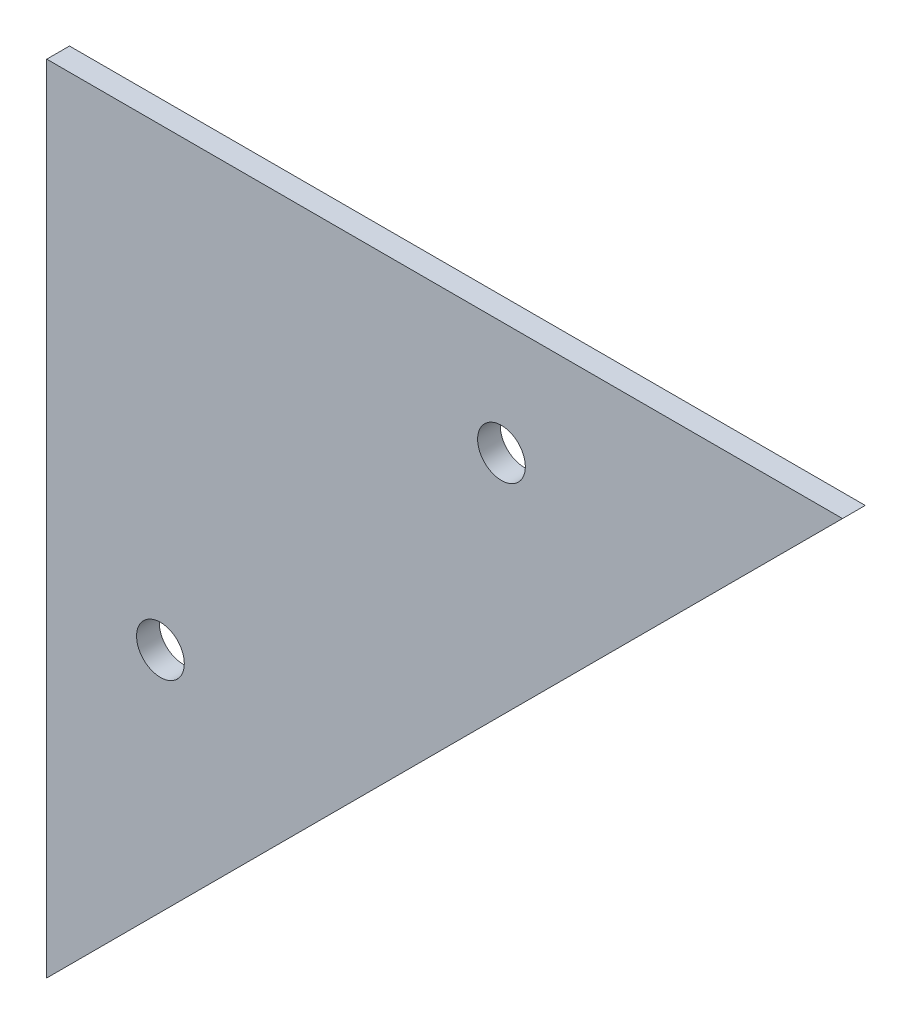
ISO-10303-21;
HEADER;
FILE_DESCRIPTION(('STEP AP214'),'2;1');
FILE_NAME('part.step','',(''),(''),'','','');
FILE_SCHEMA(('AUTOMOTIVE_DESIGN { 1 0 10303 214 1 1 1 1 }'));
ENDSEC;
DATA;
#1=APPLICATION_CONTEXT('core data for automotive mechanical design processes');
#2=APPLICATION_PROTOCOL_DEFINITION('international standard','automotive_design',2000,#1);
#3=PRODUCT_CONTEXT('',#1,'mechanical');
#4=PRODUCT('Part','Part','',(#3));
#5=PRODUCT_RELATED_PRODUCT_CATEGORY('part','',(#4));
#6=PRODUCT_DEFINITION_FORMATION('','',#4);
#7=PRODUCT_DEFINITION_CONTEXT('part definition',#1,'design');
#8=PRODUCT_DEFINITION('design','',#6,#7);
#9=PRODUCT_DEFINITION_SHAPE('','',#8);
#10=(LENGTH_UNIT() NAMED_UNIT(*) SI_UNIT(.MILLI.,.METRE.));
#11=(NAMED_UNIT(*) PLANE_ANGLE_UNIT() SI_UNIT($,.RADIAN.));
#12=(NAMED_UNIT(*) SI_UNIT($,.STERADIAN.) SOLID_ANGLE_UNIT());
#13=UNCERTAINTY_MEASURE_WITH_UNIT(LENGTH_MEASURE(1.E-05),#10,'distance_accuracy_value','');
#14=(GEOMETRIC_REPRESENTATION_CONTEXT(3) GLOBAL_UNCERTAINTY_ASSIGNED_CONTEXT((#13)) GLOBAL_UNIT_ASSIGNED_CONTEXT((#10,
#11,#12)) REPRESENTATION_CONTEXT('',''));
#15=CARTESIAN_POINT('',(0.,0.,0.));
#16=DIRECTION('',(0.,0.,1.));
#17=DIRECTION('',(1.,0.,0.));
#18=AXIS2_PLACEMENT_3D('',#15,#16,#17);
#19=CARTESIAN_POINT('',(35.,-35.,2.));
#20=DIRECTION('',(-0.707106781186548,0.707106781186547,0.));
#21=DIRECTION('',(-0.707106781186547,-0.707106781186548,0.));
#22=AXIS2_PLACEMENT_3D('',#19,#20,#21);
#23=PLANE('',#22);
#24=DIRECTION('',(0.707106781186547,0.707106781186548,0.));
#25=VECTOR('',#24,1.);
#26=CARTESIAN_POINT('',(35.,-35.,0.));
#27=LINE('',#26,#25);
#28=CARTESIAN_POINT('',(0.,-70.,0.));
#29=VERTEX_POINT('',#28);
#30=CARTESIAN_POINT('',(70.,0.,0.));
#31=VERTEX_POINT('',#30);
#32=EDGE_CURVE('E83',#29,#31,#27,.T.);
#33=ORIENTED_EDGE('',*,*,#32,.T.);
#34=DIRECTION('',(0.,0.,-1.));
#35=VECTOR('',#34,1.);
#36=CARTESIAN_POINT('',(70.,0.,2.));
#37=LINE('',#36,#35);
#38=CARTESIAN_POINT('',(70.,0.,2.));
#39=VERTEX_POINT('',#38);
#40=EDGE_CURVE('E11',#39,#31,#37,.T.);
#41=ORIENTED_EDGE('',*,*,#40,.F.);
#42=DIRECTION('',(0.707106781186547,0.707106781186548,0.));
#43=VECTOR('',#42,1.);
#44=CARTESIAN_POINT('',(35.,-35.,2.));
#45=LINE('',#44,#43);
#46=CARTESIAN_POINT('',(0.,-70.,2.));
#47=VERTEX_POINT('',#46);
#48=EDGE_CURVE('E74',#47,#39,#45,.T.);
#49=ORIENTED_EDGE('',*,*,#48,.F.);
#50=DIRECTION('',(0.,0.,-1.));
#51=VECTOR('',#50,1.);
#52=CARTESIAN_POINT('',(0.,-70.,2.));
#53=LINE('',#52,#51);
#54=EDGE_CURVE('E84',#47,#29,#53,.T.);
#55=ORIENTED_EDGE('',*,*,#54,.T.);
#56=EDGE_LOOP('',(#33,#41,#49,#55));
#57=FACE_BOUND('',#56,.T.);
#58=ADVANCED_FACE('F34',(#57),#23,.F.);
#59=CARTESIAN_POINT('',(0.,0.,2.));
#60=DIRECTION('',(0.,-1.,0.));
#61=DIRECTION('',(0.,0.,-1.));
#62=AXIS2_PLACEMENT_3D('',#59,#60,#61);
#63=PLANE('',#62);
#64=DIRECTION('',(-1.,0.,0.));
#65=VECTOR('',#64,1.);
#66=CARTESIAN_POINT('',(0.,0.,0.));
#67=LINE('',#66,#65);
#68=CARTESIAN_POINT('',(0.,0.,0.));
#69=VERTEX_POINT('',#68);
#70=EDGE_CURVE('E62',#31,#69,#67,.T.);
#71=ORIENTED_EDGE('',*,*,#70,.T.);
#72=DIRECTION('',(0.,0.,-1.));
#73=VECTOR('',#72,1.);
#74=CARTESIAN_POINT('',(0.,0.,2.));
#75=LINE('',#74,#73);
#76=CARTESIAN_POINT('',(0.,0.,2.));
#77=VERTEX_POINT('',#76);
#78=EDGE_CURVE('E42',#77,#69,#75,.T.);
#79=ORIENTED_EDGE('',*,*,#78,.F.);
#80=DIRECTION('',(-1.,0.,0.));
#81=VECTOR('',#80,1.);
#82=CARTESIAN_POINT('',(0.,0.,2.));
#83=LINE('',#82,#81);
#84=EDGE_CURVE('E70',#39,#77,#83,.T.);
#85=ORIENTED_EDGE('',*,*,#84,.F.);
#86=ORIENTED_EDGE('',*,*,#40,.T.);
#87=EDGE_LOOP('',(#71,#79,#85,#86));
#88=FACE_BOUND('',#87,.T.);
#89=ADVANCED_FACE('F71',(#88),#63,.F.);
#90=CARTESIAN_POINT('',(40.,-10.,2.));
#91=DIRECTION('',(0.,0.,-1.));
#92=DIRECTION('',(-1.,0.,0.));
#93=AXIS2_PLACEMENT_3D('',#90,#91,#92);
#94=CYLINDRICAL_SURFACE('',#93,2.1);
#95=CARTESIAN_POINT('',(40.,-10.,2.));
#96=DIRECTION('',(0.,0.,1.));
#97=DIRECTION('',(1.,0.,0.));
#98=AXIS2_PLACEMENT_3D('',#95,#96,#97);
#99=CIRCLE('',#98,2.1);
#100=CARTESIAN_POINT('',(42.1,-10.,2.));
#101=VERTEX_POINT('',#100);
#102=EDGE_CURVE('E133',#101,#101,#99,.T.);
#103=ORIENTED_EDGE('',*,*,#102,.T.);
#104=EDGE_LOOP('',(#103));
#105=FACE_BOUND('',#104,.T.);
#106=CARTESIAN_POINT('',(40.,-10.,0.));
#107=DIRECTION('',(0.,0.,1.));
#108=DIRECTION('',(1.,0.,0.));
#109=AXIS2_PLACEMENT_3D('',#106,#107,#108);
#110=CIRCLE('',#109,2.1);
#111=CARTESIAN_POINT('',(42.1,-10.,0.));
#112=VERTEX_POINT('',#111);
#113=EDGE_CURVE('E93',#112,#112,#110,.T.);
#114=ORIENTED_EDGE('',*,*,#113,.F.);
#115=EDGE_LOOP('',(#114));
#116=FACE_BOUND('',#115,.T.);
#117=ADVANCED_FACE('F116',(#105,#116),#94,.F.);
#118=CARTESIAN_POINT('',(0.,0.,2.));
#119=DIRECTION('',(1.,0.,0.));
#120=DIRECTION('',(0.,1.,0.));
#121=AXIS2_PLACEMENT_3D('',#118,#119,#120);
#122=PLANE('',#121);
#123=DIRECTION('',(0.,-1.,0.));
#124=VECTOR('',#123,1.);
#125=CARTESIAN_POINT('',(0.,0.,0.));
#126=LINE('',#125,#124);
#127=EDGE_CURVE('E67',#69,#29,#126,.T.);
#128=ORIENTED_EDGE('',*,*,#127,.T.);
#129=ORIENTED_EDGE('',*,*,#54,.F.);
#130=DIRECTION('',(0.,-1.,0.));
#131=VECTOR('',#130,1.);
#132=CARTESIAN_POINT('',(0.,0.,2.));
#133=LINE('',#132,#131);
#134=EDGE_CURVE('E50',#77,#47,#133,.T.);
#135=ORIENTED_EDGE('',*,*,#134,.F.);
#136=ORIENTED_EDGE('',*,*,#78,.T.);
#137=EDGE_LOOP('',(#128,#129,#135,#136));
#138=FACE_BOUND('',#137,.T.);
#139=ADVANCED_FACE('F98',(#138),#122,.F.);
#140=CARTESIAN_POINT('',(10.,-40.,2.));
#141=DIRECTION('',(0.,0.,-1.));
#142=DIRECTION('',(-1.,0.,0.));
#143=AXIS2_PLACEMENT_3D('',#140,#141,#142);
#144=CYLINDRICAL_SURFACE('',#143,2.1);
#145=CARTESIAN_POINT('',(10.,-40.,2.));
#146=DIRECTION('',(0.,0.,1.));
#147=DIRECTION('',(1.,0.,0.));
#148=AXIS2_PLACEMENT_3D('',#145,#146,#147);
#149=CIRCLE('',#148,2.1);
#150=CARTESIAN_POINT('',(12.1,-40.,2.));
#151=VERTEX_POINT('',#150);
#152=EDGE_CURVE('E89',#151,#151,#149,.T.);
#153=ORIENTED_EDGE('',*,*,#152,.T.);
#154=EDGE_LOOP('',(#153));
#155=FACE_BOUND('',#154,.T.);
#156=CARTESIAN_POINT('',(10.,-40.,0.));
#157=DIRECTION('',(0.,0.,1.));
#158=DIRECTION('',(1.,0.,0.));
#159=AXIS2_PLACEMENT_3D('',#156,#157,#158);
#160=CIRCLE('',#159,2.1);
#161=CARTESIAN_POINT('',(12.1,-40.,0.));
#162=VERTEX_POINT('',#161);
#163=EDGE_CURVE('E80',#162,#162,#160,.T.);
#164=ORIENTED_EDGE('',*,*,#163,.F.);
#165=EDGE_LOOP('',(#164));
#166=FACE_BOUND('',#165,.T.);
#167=ADVANCED_FACE('F107',(#155,#166),#144,.F.);
#168=CARTESIAN_POINT('',(0.,0.,2.));
#169=DIRECTION('',(0.,0.,1.));
#170=DIRECTION('',(1.,0.,0.));
#171=AXIS2_PLACEMENT_3D('',#168,#169,#170);
#172=PLANE('',#171);
#173=ORIENTED_EDGE('',*,*,#48,.T.);
#174=ORIENTED_EDGE('',*,*,#84,.T.);
#175=ORIENTED_EDGE('',*,*,#134,.T.);
#176=EDGE_LOOP('',(#173,#174,#175));
#177=FACE_BOUND('',#176,.T.);
#178=ORIENTED_EDGE('',*,*,#102,.F.);
#179=EDGE_LOOP('',(#178));
#180=FACE_BOUND('',#179,.T.);
#181=ORIENTED_EDGE('',*,*,#152,.F.);
#182=EDGE_LOOP('',(#181));
#183=FACE_BOUND('',#182,.T.);
#184=ADVANCED_FACE('F77',(#177,#180,#183),#172,.T.);
#185=CARTESIAN_POINT('',(0.,0.,0.));
#186=DIRECTION('',(0.,0.,1.));
#187=DIRECTION('',(1.,0.,0.));
#188=AXIS2_PLACEMENT_3D('',#185,#186,#187);
#189=PLANE('',#188);
#190=ORIENTED_EDGE('',*,*,#32,.F.);
#191=ORIENTED_EDGE('',*,*,#127,.F.);
#192=ORIENTED_EDGE('',*,*,#70,.F.);
#193=EDGE_LOOP('',(#190,#191,#192));
#194=FACE_BOUND('',#193,.T.);
#195=ORIENTED_EDGE('',*,*,#113,.T.);
#196=EDGE_LOOP('',(#195));
#197=FACE_BOUND('',#196,.T.);
#198=ORIENTED_EDGE('',*,*,#163,.T.);
#199=EDGE_LOOP('',(#198));
#200=FACE_BOUND('',#199,.T.);
#201=ADVANCED_FACE('F99',(#194,#197,#200),#189,.F.);
#202=CLOSED_SHELL('',(#58,#89,#117,#139,#167,#184,#201));
#203=MANIFOLD_SOLID_BREP('B2',#202);
#204=ADVANCED_BREP_SHAPE_REPRESENTATION('',(#18,#203),#14);
#205=SHAPE_DEFINITION_REPRESENTATION(#9,#204);
ENDSEC;
END-ISO-10303-21;
